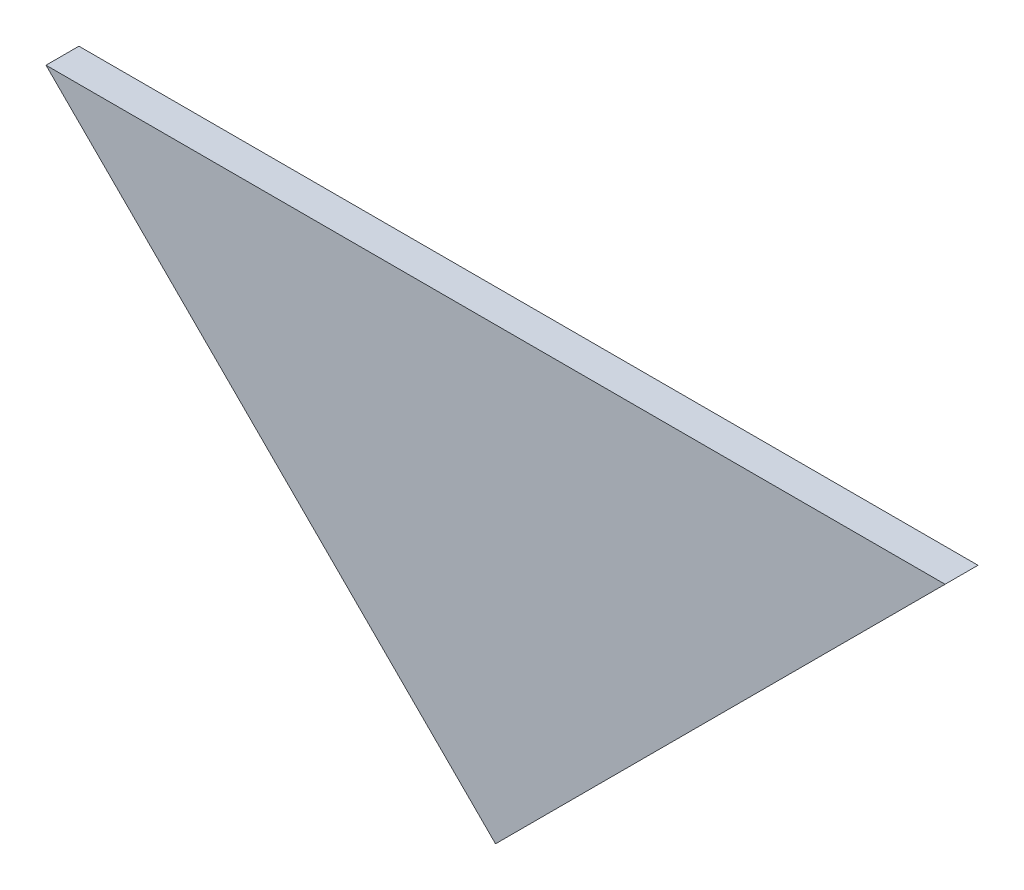
ISO-10303-21;
HEADER;
FILE_DESCRIPTION(('STEP AP214'),'2;1');
FILE_NAME('part.step','',(''),(''),'','','');
FILE_SCHEMA(('AUTOMOTIVE_DESIGN { 1 0 10303 214 1 1 1 1 }'));
ENDSEC;
DATA;
#1=APPLICATION_CONTEXT('core data for automotive mechanical design processes');
#2=APPLICATION_PROTOCOL_DEFINITION('international standard','automotive_design',2000,#1);
#3=PRODUCT_CONTEXT('',#1,'mechanical');
#4=PRODUCT('Part','Part','',(#3));
#5=PRODUCT_RELATED_PRODUCT_CATEGORY('part','',(#4));
#6=PRODUCT_DEFINITION_FORMATION('','',#4);
#7=PRODUCT_DEFINITION_CONTEXT('part definition',#1,'design');
#8=PRODUCT_DEFINITION('design','',#6,#7);
#9=PRODUCT_DEFINITION_SHAPE('','',#8);
#10=(LENGTH_UNIT() NAMED_UNIT(*) SI_UNIT(.MILLI.,.METRE.));
#11=(NAMED_UNIT(*) PLANE_ANGLE_UNIT() SI_UNIT($,.RADIAN.));
#12=(NAMED_UNIT(*) SI_UNIT($,.STERADIAN.) SOLID_ANGLE_UNIT());
#13=UNCERTAINTY_MEASURE_WITH_UNIT(LENGTH_MEASURE(1.E-05),#10,'distance_accuracy_value','');
#14=(GEOMETRIC_REPRESENTATION_CONTEXT(3) GLOBAL_UNCERTAINTY_ASSIGNED_CONTEXT((#13)) GLOBAL_UNIT_ASSIGNED_CONTEXT((#10,
#11,#12)) REPRESENTATION_CONTEXT('',''));
#15=CARTESIAN_POINT('',(0.,0.,0.));
#16=DIRECTION('',(0.,0.,1.));
#17=DIRECTION('',(1.,0.,0.));
#18=AXIS2_PLACEMENT_3D('',#15,#16,#17);
#19=CARTESIAN_POINT('',(0.,-157.21087812715,112.204878));
#20=DIRECTION('',(0.707106781186548,-0.707106781186547,0.));
#21=DIRECTION('',(0.707106781186547,0.707106781186548,0.));
#22=AXIS2_PLACEMENT_3D('',#19,#20,#21);
#23=PLANE('',#22);
#24=DIRECTION('',(0.707106781186547,0.707106781186548,0.));
#25=VECTOR('',#24,1.);
#26=CARTESIAN_POINT('',(0.,-157.21087812715,115.204878));
#27=LINE('',#26,#25);
#28=CARTESIAN_POINT('',(0.,-157.21087812715,115.204878));
#29=VERTEX_POINT('',#28);
#30=CARTESIAN_POINT('',(40.9660001271504,-116.244878,115.204878));
#31=VERTEX_POINT('',#30);
#32=EDGE_CURVE('E96',#29,#31,#27,.T.);
#33=ORIENTED_EDGE('',*,*,#32,.F.);
#34=DIRECTION('',(0.,0.,1.));
#35=VECTOR('',#34,1.);
#36=CARTESIAN_POINT('',(0.,-157.21087812715,112.204878));
#37=LINE('',#36,#35);
#38=CARTESIAN_POINT('',(0.,-157.21087812715,112.204878));
#39=VERTEX_POINT('',#38);
#40=EDGE_CURVE('E11',#39,#29,#37,.T.);
#41=ORIENTED_EDGE('',*,*,#40,.F.);
#42=DIRECTION('',(0.707106781186547,0.707106781186548,0.));
#43=VECTOR('',#42,1.);
#44=CARTESIAN_POINT('',(0.,-157.21087812715,112.204878));
#45=LINE('',#44,#43);
#46=CARTESIAN_POINT('',(40.9660001271504,-116.244878,112.204878));
#47=VERTEX_POINT('',#46);
#48=EDGE_CURVE('E85',#39,#47,#45,.T.);
#49=ORIENTED_EDGE('',*,*,#48,.T.);
#50=DIRECTION('',(0.,0.,1.));
#51=VECTOR('',#50,1.);
#52=CARTESIAN_POINT('',(40.9660001271504,-116.244878,112.204878));
#53=LINE('',#52,#51);
#54=EDGE_CURVE('E40',#47,#31,#53,.T.);
#55=ORIENTED_EDGE('',*,*,#54,.T.);
#56=EDGE_LOOP('',(#33,#41,#49,#55));
#57=FACE_BOUND('',#56,.T.);
#58=ADVANCED_FACE('F37',(#57),#23,.T.);
#59=CARTESIAN_POINT('',(-40.9660001271505,-116.244878,112.204878));
#60=DIRECTION('',(-0.707106781186547,-0.707106781186548,0.));
#61=DIRECTION('',(0.707106781186548,-0.707106781186547,0.));
#62=AXIS2_PLACEMENT_3D('',#59,#60,#61);
#63=PLANE('',#62);
#64=DIRECTION('',(0.707106781186548,-0.707106781186547,0.));
#65=VECTOR('',#64,1.);
#66=CARTESIAN_POINT('',(-40.9660001271505,-116.244878,115.204878));
#67=LINE('',#66,#65);
#68=CARTESIAN_POINT('',(-40.9660001271505,-116.244878,115.204878));
#69=VERTEX_POINT('',#68);
#70=EDGE_CURVE('E89',#69,#29,#67,.T.);
#71=ORIENTED_EDGE('',*,*,#70,.F.);
#72=DIRECTION('',(0.,0.,1.));
#73=VECTOR('',#72,1.);
#74=CARTESIAN_POINT('',(-40.9660001271505,-116.244878,112.204878));
#75=LINE('',#74,#73);
#76=CARTESIAN_POINT('',(-40.9660001271505,-116.244878,112.204878));
#77=VERTEX_POINT('',#76);
#78=EDGE_CURVE('E47',#77,#69,#75,.T.);
#79=ORIENTED_EDGE('',*,*,#78,.F.);
#80=DIRECTION('',(0.707106781186548,-0.707106781186547,0.));
#81=VECTOR('',#80,1.);
#82=CARTESIAN_POINT('',(-40.9660001271505,-116.244878,112.204878));
#83=LINE('',#82,#81);
#84=EDGE_CURVE('E82',#77,#39,#83,.T.);
#85=ORIENTED_EDGE('',*,*,#84,.T.);
#86=ORIENTED_EDGE('',*,*,#40,.T.);
#87=EDGE_LOOP('',(#71,#79,#85,#86));
#88=FACE_BOUND('',#87,.T.);
#89=ADVANCED_FACE('F101',(#88),#63,.T.);
#90=CARTESIAN_POINT('',(40.9660001271504,-116.244878,112.204878));
#91=DIRECTION('',(0.,1.,0.));
#92=DIRECTION('',(-1.,0.,0.));
#93=AXIS2_PLACEMENT_3D('',#90,#91,#92);
#94=PLANE('',#93);
#95=DIRECTION('',(-1.,0.,0.));
#96=VECTOR('',#95,1.);
#97=CARTESIAN_POINT('',(40.9660001271504,-116.244878,115.204878));
#98=LINE('',#97,#96);
#99=EDGE_CURVE('E79',#31,#69,#98,.T.);
#100=ORIENTED_EDGE('',*,*,#99,.F.);
#101=ORIENTED_EDGE('',*,*,#54,.F.);
#102=DIRECTION('',(-1.,0.,0.));
#103=VECTOR('',#102,1.);
#104=CARTESIAN_POINT('',(40.9660001271504,-116.244878,112.204878));
#105=LINE('',#104,#103);
#106=EDGE_CURVE('E77',#47,#77,#105,.T.);
#107=ORIENTED_EDGE('',*,*,#106,.T.);
#108=ORIENTED_EDGE('',*,*,#78,.T.);
#109=EDGE_LOOP('',(#100,#101,#107,#108));
#110=FACE_BOUND('',#109,.T.);
#111=ADVANCED_FACE('F76',(#110),#94,.T.);
#112=CARTESIAN_POINT('',(0.,0.,112.204878));
#113=DIRECTION('',(0.,0.,-1.));
#114=DIRECTION('',(-1.,0.,0.));
#115=AXIS2_PLACEMENT_3D('',#112,#113,#114);
#116=PLANE('',#115);
#117=ORIENTED_EDGE('',*,*,#48,.F.);
#118=ORIENTED_EDGE('',*,*,#84,.F.);
#119=ORIENTED_EDGE('',*,*,#106,.F.);
#120=EDGE_LOOP('',(#117,#118,#119));
#121=FACE_BOUND('',#120,.T.);
#122=ADVANCED_FACE('F84',(#121),#116,.T.);
#123=CARTESIAN_POINT('',(0.,0.,115.204878));
#124=DIRECTION('',(0.,0.,-1.));
#125=DIRECTION('',(-1.,0.,0.));
#126=AXIS2_PLACEMENT_3D('',#123,#124,#125);
#127=PLANE('',#126);
#128=ORIENTED_EDGE('',*,*,#32,.T.);
#129=ORIENTED_EDGE('',*,*,#99,.T.);
#130=ORIENTED_EDGE('',*,*,#70,.T.);
#131=EDGE_LOOP('',(#128,#129,#130));
#132=FACE_BOUND('',#131,.T.);
#133=ADVANCED_FACE('F100',(#132),#127,.F.);
#134=CLOSED_SHELL('',(#58,#89,#111,#122,#133));
#135=MANIFOLD_SOLID_BREP('B2',#134);
#136=ADVANCED_BREP_SHAPE_REPRESENTATION('',(#18,#135),#14);
#137=SHAPE_DEFINITION_REPRESENTATION(#9,#136);
ENDSEC;
END-ISO-10303-21;
